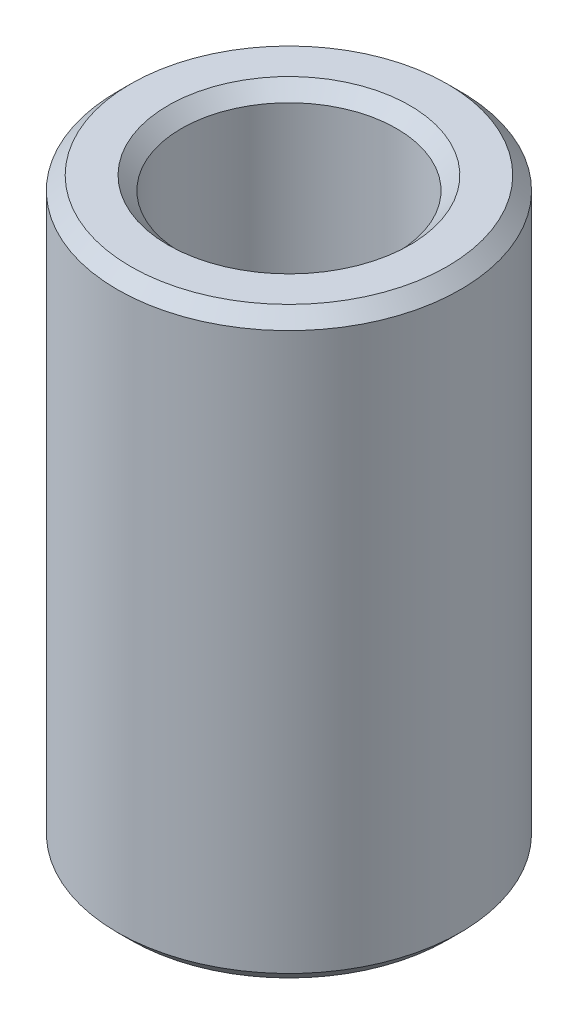
ISO-10303-21;
HEADER;
FILE_DESCRIPTION(('STEP AP214'),'2;1');
FILE_NAME('part.step','',(''),(''),'','','');
FILE_SCHEMA(('AUTOMOTIVE_DESIGN { 1 0 10303 214 1 1 1 1 }'));
ENDSEC;
DATA;
#1=APPLICATION_CONTEXT('core data for automotive mechanical design processes');
#2=APPLICATION_PROTOCOL_DEFINITION('international standard','automotive_design',2000,#1);
#3=PRODUCT_CONTEXT('',#1,'mechanical');
#4=PRODUCT('Part','Part','',(#3));
#5=PRODUCT_RELATED_PRODUCT_CATEGORY('part','',(#4));
#6=PRODUCT_DEFINITION_FORMATION('','',#4);
#7=PRODUCT_DEFINITION_CONTEXT('part definition',#1,'design');
#8=PRODUCT_DEFINITION('design','',#6,#7);
#9=PRODUCT_DEFINITION_SHAPE('','',#8);
#10=(LENGTH_UNIT() NAMED_UNIT(*) SI_UNIT(.MILLI.,.METRE.));
#11=(NAMED_UNIT(*) PLANE_ANGLE_UNIT() SI_UNIT($,.RADIAN.));
#12=(NAMED_UNIT(*) SI_UNIT($,.STERADIAN.) SOLID_ANGLE_UNIT());
#13=UNCERTAINTY_MEASURE_WITH_UNIT(LENGTH_MEASURE(1.E-05),#10,'distance_accuracy_value','');
#14=(GEOMETRIC_REPRESENTATION_CONTEXT(3) GLOBAL_UNCERTAINTY_ASSIGNED_CONTEXT((#13)) GLOBAL_UNIT_ASSIGNED_CONTEXT((#10,
#11,#12)) REPRESENTATION_CONTEXT('',''));
#15=CARTESIAN_POINT('',(0.,0.,0.));
#16=DIRECTION('',(0.,0.,1.));
#17=DIRECTION('',(1.,0.,0.));
#18=AXIS2_PLACEMENT_3D('',#15,#16,#17);
#19=CARTESIAN_POINT('',(0.,93.5068929613808,0.));
#20=DIRECTION('',(0.,-1.,0.));
#21=DIRECTION('',(0.,0.,-1.));
#22=AXIS2_PLACEMENT_3D('',#19,#20,#21);
#23=CYLINDRICAL_SURFACE('',#22,27.5);
#24=CARTESIAN_POINT('',(0.,2.132583374359,0.));
#25=DIRECTION('',(0.,1.,0.));
#26=DIRECTION('',(0.,0.,1.));
#27=AXIS2_PLACEMENT_3D('',#24,#25,#26);
#28=CIRCLE('',#27,27.5);
#29=CARTESIAN_POINT('',(0.,2.132583374359,27.5));
#30=VERTEX_POINT('',#29);
#31=EDGE_CURVE('E10',#30,#30,#28,.T.);
#32=ORIENTED_EDGE('',*,*,#31,.T.);
#33=EDGE_LOOP('',(#32));
#34=FACE_BOUND('',#33,.T.);
#35=CARTESIAN_POINT('',(0.,91.3743095870218,0.));
#36=DIRECTION('',(0.,1.,0.));
#37=DIRECTION('',(0.,0.,1.));
#38=AXIS2_PLACEMENT_3D('',#35,#36,#37);
#39=CIRCLE('',#38,27.5);
#40=CARTESIAN_POINT('',(0.,91.3743095870218,27.5));
#41=VERTEX_POINT('',#40);
#42=EDGE_CURVE('E50',#41,#41,#39,.F.);
#43=ORIENTED_EDGE('',*,*,#42,.T.);
#44=EDGE_LOOP('',(#43));
#45=FACE_BOUND('',#44,.T.);
#46=ADVANCED_FACE('F39',(#34,#45),#23,.T.);
#47=CARTESIAN_POINT('',(0.,93.5068929613808,0.));
#48=DIRECTION('',(0.,1.,0.));
#49=DIRECTION('',(0.,0.,1.));
#50=AXIS2_PLACEMENT_3D('',#47,#48,#49);
#51=PLANE('',#50);
#52=CARTESIAN_POINT('',(0.,93.5068929613808,0.));
#53=DIRECTION('',(0.,1.,0.));
#54=DIRECTION('',(0.,0.,1.));
#55=AXIS2_PLACEMENT_3D('',#52,#53,#54);
#56=CIRCLE('',#55,19.3759853800141);
#57=CARTESIAN_POINT('',(0.,93.5068929613808,19.3759853800141));
#58=VERTEX_POINT('',#57);
#59=EDGE_CURVE('E58',#58,#58,#56,.F.);
#60=ORIENTED_EDGE('',*,*,#59,.T.);
#61=EDGE_LOOP('',(#60));
#62=FACE_BOUND('',#61,.T.);
#63=CARTESIAN_POINT('',(0.,93.5068929613808,0.));
#64=DIRECTION('',(0.,1.,0.));
#65=DIRECTION('',(0.,0.,1.));
#66=AXIS2_PLACEMENT_3D('',#63,#64,#65);
#67=CIRCLE('',#66,25.367416625641);
#68=CARTESIAN_POINT('',(0.,93.5068929613808,25.367416625641));
#69=VERTEX_POINT('',#68);
#70=EDGE_CURVE('E61',#69,#69,#67,.T.);
#71=ORIENTED_EDGE('',*,*,#70,.T.);
#72=EDGE_LOOP('',(#71));
#73=FACE_BOUND('',#72,.T.);
#74=ADVANCED_FACE('F88',(#62,#73),#51,.T.);
#75=CARTESIAN_POINT('',(0.,0.,0.));
#76=DIRECTION('',(0.,1.,0.));
#77=DIRECTION('',(0.,0.,1.));
#78=AXIS2_PLACEMENT_3D('',#75,#76,#77);
#79=PLANE('',#78);
#80=CARTESIAN_POINT('',(0.,0.,0.));
#81=DIRECTION('',(0.,1.,0.));
#82=DIRECTION('',(0.,0.,1.));
#83=AXIS2_PLACEMENT_3D('',#80,#81,#82);
#84=CIRCLE('',#83,19.375985380014);
#85=CARTESIAN_POINT('',(0.,0.,19.375985380014));
#86=VERTEX_POINT('',#85);
#87=EDGE_CURVE('E51',#86,#86,#84,.T.);
#88=ORIENTED_EDGE('',*,*,#87,.T.);
#89=EDGE_LOOP('',(#88));
#90=FACE_BOUND('',#89,.T.);
#91=CARTESIAN_POINT('',(0.,0.,0.));
#92=DIRECTION('',(0.,1.,0.));
#93=DIRECTION('',(0.,0.,1.));
#94=AXIS2_PLACEMENT_3D('',#91,#92,#93);
#95=CIRCLE('',#94,25.367416625641);
#96=CARTESIAN_POINT('',(0.,0.,25.367416625641));
#97=VERTEX_POINT('',#96);
#98=EDGE_CURVE('E54',#97,#97,#95,.F.);
#99=ORIENTED_EDGE('',*,*,#98,.T.);
#100=EDGE_LOOP('',(#99));
#101=FACE_BOUND('',#100,.T.);
#102=ADVANCED_FACE('F83',(#90,#101),#79,.F.);
#103=CARTESIAN_POINT('',(0.,93.5068929613808,0.));
#104=DIRECTION('',(0.,-1.,0.));
#105=DIRECTION('',(0.,0.,-1.));
#106=AXIS2_PLACEMENT_3D('',#103,#104,#105);
#107=CYLINDRICAL_SURFACE('',#106,17.2434020056551);
#108=CARTESIAN_POINT('',(0.,91.3743095870218,0.));
#109=DIRECTION('',(0.,1.,0.));
#110=DIRECTION('',(0.,0.,1.));
#111=AXIS2_PLACEMENT_3D('',#108,#109,#110);
#112=CIRCLE('',#111,17.2434020056551);
#113=CARTESIAN_POINT('',(0.,91.3743095870218,17.2434020056551));
#114=VERTEX_POINT('',#113);
#115=EDGE_CURVE('E67',#114,#114,#112,.T.);
#116=ORIENTED_EDGE('',*,*,#115,.T.);
#117=EDGE_LOOP('',(#116));
#118=FACE_BOUND('',#117,.T.);
#119=CARTESIAN_POINT('',(0.,2.13258337435901,0.));
#120=DIRECTION('',(0.,1.,0.));
#121=DIRECTION('',(0.,0.,1.));
#122=AXIS2_PLACEMENT_3D('',#119,#120,#121);
#123=CIRCLE('',#122,17.2434020056551);
#124=CARTESIAN_POINT('',(0.,2.13258337435901,17.2434020056551));
#125=VERTEX_POINT('',#124);
#126=EDGE_CURVE('E69',#125,#125,#123,.F.);
#127=ORIENTED_EDGE('',*,*,#126,.T.);
#128=EDGE_LOOP('',(#127));
#129=FACE_BOUND('',#128,.T.);
#130=ADVANCED_FACE('F71',(#118,#129),#107,.F.);
#131=CARTESIAN_POINT('',(0.,91.3743095870218,0.));
#132=DIRECTION('',(0.,1.,0.));
#133=DIRECTION('',(0.,0.,1.));
#134=AXIS2_PLACEMENT_3D('',#131,#132,#133);
#135=CONICAL_SURFACE('',#134,17.2434020056551,0.785398163397453);
#136=ORIENTED_EDGE('',*,*,#59,.F.);
#137=EDGE_LOOP('',(#136));
#138=FACE_BOUND('',#137,.T.);
#139=ORIENTED_EDGE('',*,*,#115,.F.);
#140=EDGE_LOOP('',(#139));
#141=FACE_BOUND('',#140,.T.);
#142=ADVANCED_FACE('F77',(#138,#141),#135,.F.);
#143=CARTESIAN_POINT('',(0.,0.,0.));
#144=DIRECTION('',(0.,-1.,0.));
#145=DIRECTION('',(0.,0.,-1.));
#146=AXIS2_PLACEMENT_3D('',#143,#144,#145);
#147=CONICAL_SURFACE('',#146,19.375985380014,0.785398163397443);
#148=ORIENTED_EDGE('',*,*,#126,.F.);
#149=EDGE_LOOP('',(#148));
#150=FACE_BOUND('',#149,.T.);
#151=ORIENTED_EDGE('',*,*,#87,.F.);
#152=EDGE_LOOP('',(#151));
#153=FACE_BOUND('',#152,.T.);
#154=ADVANCED_FACE('F73',(#150,#153),#147,.F.);
#155=CARTESIAN_POINT('',(0.,2.132583374359,0.));
#156=DIRECTION('',(0.,1.,0.));
#157=DIRECTION('',(0.,0.,1.));
#158=AXIS2_PLACEMENT_3D('',#155,#156,#157);
#159=CONICAL_SURFACE('',#158,27.5,0.785398163397452);
#160=ORIENTED_EDGE('',*,*,#98,.F.);
#161=EDGE_LOOP('',(#160));
#162=FACE_BOUND('',#161,.T.);
#163=ORIENTED_EDGE('',*,*,#31,.F.);
#164=EDGE_LOOP('',(#163));
#165=FACE_BOUND('',#164,.T.);
#166=ADVANCED_FACE('F76',(#162,#165),#159,.T.);
#167=CARTESIAN_POINT('',(0.,93.5068929613808,0.));
#168=DIRECTION('',(0.,-1.,0.));
#169=DIRECTION('',(0.,0.,-1.));
#170=AXIS2_PLACEMENT_3D('',#167,#168,#169);
#171=CONICAL_SURFACE('',#170,25.367416625641,0.785398163397446);
#172=ORIENTED_EDGE('',*,*,#42,.F.);
#173=EDGE_LOOP('',(#172));
#174=FACE_BOUND('',#173,.T.);
#175=ORIENTED_EDGE('',*,*,#70,.F.);
#176=EDGE_LOOP('',(#175));
#177=FACE_BOUND('',#176,.T.);
#178=ADVANCED_FACE('F45',(#174,#177),#171,.T.);
#179=CLOSED_SHELL('',(#46,#74,#102,#130,#142,#154,#166,#178));
#180=MANIFOLD_SOLID_BREP('B2',#179);
#181=ADVANCED_BREP_SHAPE_REPRESENTATION('',(#18,#180),#14);
#182=SHAPE_DEFINITION_REPRESENTATION(#9,#181);
ENDSEC;
END-ISO-10303-21;
